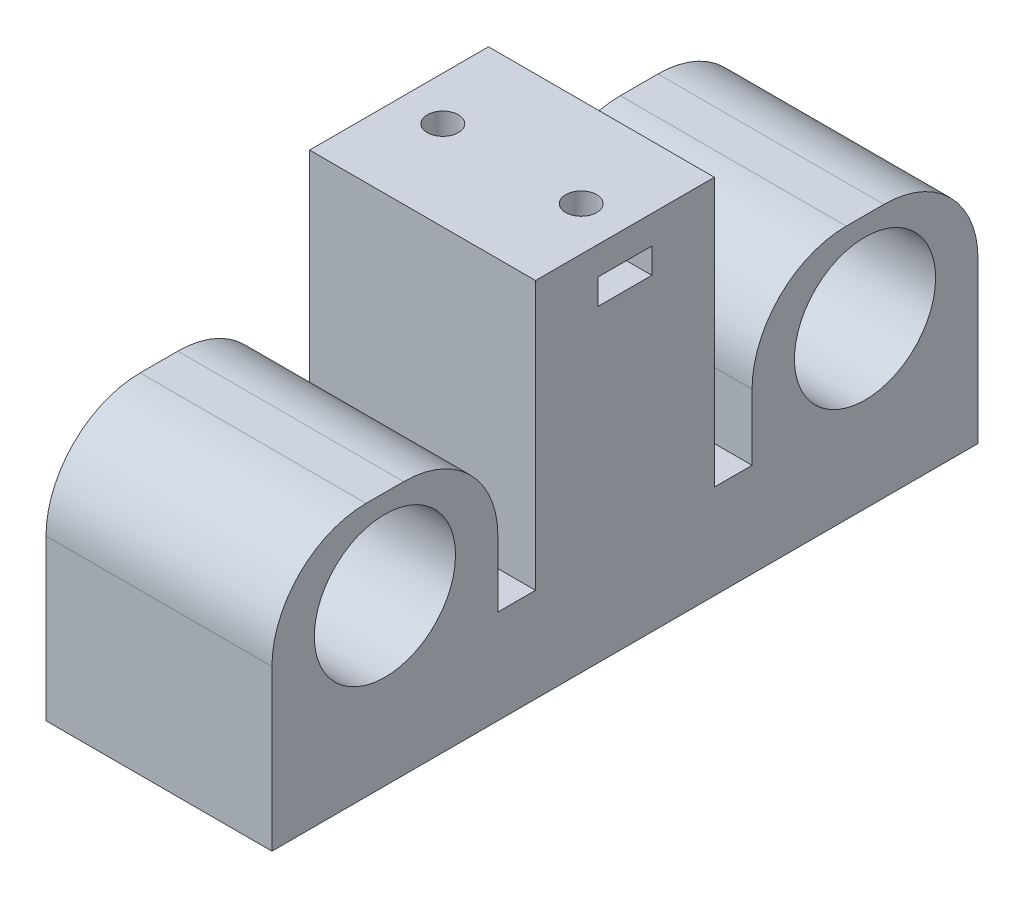
ISO-10303-21;
HEADER;
FILE_DESCRIPTION(('STEP AP214'),'2;1');
FILE_NAME('part.step','',(''),(''),'','','');
FILE_SCHEMA(('AUTOMOTIVE_DESIGN { 1 0 10303 214 1 1 1 1 }'));
ENDSEC;
DATA;
#1=APPLICATION_CONTEXT('core data for automotive mechanical design processes');
#2=APPLICATION_PROTOCOL_DEFINITION('international standard','automotive_design',2000,#1);
#3=PRODUCT_CONTEXT('',#1,'mechanical');
#4=PRODUCT('Part','Part','',(#3));
#5=PRODUCT_RELATED_PRODUCT_CATEGORY('part','',(#4));
#6=PRODUCT_DEFINITION_FORMATION('','',#4);
#7=PRODUCT_DEFINITION_CONTEXT('part definition',#1,'design');
#8=PRODUCT_DEFINITION('design','',#6,#7);
#9=PRODUCT_DEFINITION_SHAPE('','',#8);
#10=(LENGTH_UNIT() NAMED_UNIT(*) SI_UNIT(.MILLI.,.METRE.));
#11=(NAMED_UNIT(*) PLANE_ANGLE_UNIT() SI_UNIT($,.RADIAN.));
#12=(NAMED_UNIT(*) SI_UNIT($,.STERADIAN.) SOLID_ANGLE_UNIT());
#13=UNCERTAINTY_MEASURE_WITH_UNIT(LENGTH_MEASURE(1.E-05),#10,'distance_accuracy_value','');
#14=(GEOMETRIC_REPRESENTATION_CONTEXT(3) GLOBAL_UNCERTAINTY_ASSIGNED_CONTEXT((#13)) GLOBAL_UNIT_ASSIGNED_CONTEXT((#10,
#11,#12)) REPRESENTATION_CONTEXT('',''));
#15=CARTESIAN_POINT('',(0.,0.,0.));
#16=DIRECTION('',(0.,0.,1.));
#17=DIRECTION('',(1.,0.,0.));
#18=AXIS2_PLACEMENT_3D('',#15,#16,#17);
#19=CARTESIAN_POINT('',(0.,10.,-75.));
#20=DIRECTION('',(-1.,0.,0.));
#21=DIRECTION('',(0.,0.,1.));
#22=AXIS2_PLACEMENT_3D('',#19,#20,#21);
#23=PLANE('',#22);
#24=DIRECTION('',(0.,0.,-1.));
#25=VECTOR('',#24,1.);
#26=CARTESIAN_POINT('',(0.,27.,-75.));
#27=LINE('',#26,#25);
#28=CARTESIAN_POINT('',(0.,27.,-61.));
#29=VERTEX_POINT('',#28);
#30=CARTESIAN_POINT('',(0.,27.,-65.));
#31=VERTEX_POINT('',#30);
#32=EDGE_CURVE('E296',#29,#31,#27,.T.);
#33=ORIENTED_EDGE('',*,*,#32,.F.);
#34=CARTESIAN_POINT('',(0.,17.,-61.));
#35=DIRECTION('',(-1.,0.,0.));
#36=DIRECTION('',(0.,0.,1.));
#37=AXIS2_PLACEMENT_3D('',#34,#35,#36);
#38=CIRCLE('',#37,10.);
#39=CARTESIAN_POINT('',(0.,17.,-51.));
#40=VERTEX_POINT('',#39);
#41=EDGE_CURVE('E392',#29,#40,#38,.F.);
#42=ORIENTED_EDGE('',*,*,#41,.T.);
#43=DIRECTION('',(0.,-1.,0.));
#44=VECTOR('',#43,1.);
#45=CARTESIAN_POINT('',(0.,27.,-51.));
#46=LINE('',#45,#44);
#47=CARTESIAN_POINT('',(0.,10.,-51.));
#48=VERTEX_POINT('',#47);
#49=EDGE_CURVE('E299',#40,#48,#46,.T.);
#50=ORIENTED_EDGE('',*,*,#49,.T.);
#51=DIRECTION('',(0.,0.,-1.));
#52=VECTOR('',#51,1.);
#53=CARTESIAN_POINT('',(0.,10.,-75.));
#54=LINE('',#53,#52);
#55=CARTESIAN_POINT('',(0.,10.,-47.));
#56=VERTEX_POINT('',#55);
#57=EDGE_CURVE('E350',#56,#48,#54,.T.);
#58=ORIENTED_EDGE('',*,*,#57,.F.);
#59=DIRECTION('',(0.,-1.,0.));
#60=VECTOR('',#59,1.);
#61=CARTESIAN_POINT('',(0.,38.5,-47.));
#62=LINE('',#61,#60);
#63=CARTESIAN_POINT('',(0.,38.5,-47.));
#64=VERTEX_POINT('',#63);
#65=EDGE_CURVE('E277',#64,#56,#62,.T.);
#66=ORIENTED_EDGE('',*,*,#65,.F.);
#67=DIRECTION('',(0.,0.,-1.));
#68=VECTOR('',#67,1.);
#69=CARTESIAN_POINT('',(0.,38.5,-47.));
#70=LINE('',#69,#68);
#71=CARTESIAN_POINT('',(0.,38.5,-28.));
#72=VERTEX_POINT('',#71);
#73=EDGE_CURVE('E254',#72,#64,#70,.T.);
#74=ORIENTED_EDGE('',*,*,#73,.F.);
#75=DIRECTION('',(0.,-1.,0.));
#76=VECTOR('',#75,1.);
#77=CARTESIAN_POINT('',(0.,38.5,-28.));
#78=LINE('',#77,#76);
#79=CARTESIAN_POINT('',(0.,10.,-28.));
#80=VERTEX_POINT('',#79);
#81=EDGE_CURVE('E264',#72,#80,#78,.T.);
#82=ORIENTED_EDGE('',*,*,#81,.T.);
#83=CARTESIAN_POINT('',(0.,10.,-24.));
#84=VERTEX_POINT('',#83);
#85=EDGE_CURVE('E321',#84,#80,#54,.T.);
#86=ORIENTED_EDGE('',*,*,#85,.F.);
#87=DIRECTION('',(0.,-1.,0.));
#88=VECTOR('',#87,1.);
#89=CARTESIAN_POINT('',(0.,27.,-24.));
#90=LINE('',#89,#88);
#91=CARTESIAN_POINT('',(0.,17.,-24.));
#92=VERTEX_POINT('',#91);
#93=EDGE_CURVE('E331',#92,#84,#90,.T.);
#94=ORIENTED_EDGE('',*,*,#93,.F.);
#95=CARTESIAN_POINT('',(0.,17.,-14.));
#96=DIRECTION('',(-1.,0.,0.));
#97=DIRECTION('',(0.,0.,1.));
#98=AXIS2_PLACEMENT_3D('',#95,#96,#97);
#99=CIRCLE('',#98,10.);
#100=CARTESIAN_POINT('',(0.,27.,-14.));
#101=VERTEX_POINT('',#100);
#102=EDGE_CURVE('E391',#92,#101,#99,.F.);
#103=ORIENTED_EDGE('',*,*,#102,.T.);
#104=DIRECTION('',(0.,0.,-1.));
#105=VECTOR('',#104,1.);
#106=CARTESIAN_POINT('',(0.,27.,0.));
#107=LINE('',#106,#105);
#108=CARTESIAN_POINT('',(0.,27.,-10.));
#109=VERTEX_POINT('',#108);
#110=EDGE_CURVE('E310',#109,#101,#107,.T.);
#111=ORIENTED_EDGE('',*,*,#110,.F.);
#112=CARTESIAN_POINT('',(0.,17.,-10.));
#113=DIRECTION('',(-1.,0.,0.));
#114=DIRECTION('',(0.,0.,1.));
#115=AXIS2_PLACEMENT_3D('',#112,#113,#114);
#116=CIRCLE('',#115,10.);
#117=CARTESIAN_POINT('',(0.,17.,0.));
#118=VERTEX_POINT('',#117);
#119=EDGE_CURVE('E389',#109,#118,#116,.F.);
#120=ORIENTED_EDGE('',*,*,#119,.T.);
#121=DIRECTION('',(0.,-1.,0.));
#122=VECTOR('',#121,1.);
#123=CARTESIAN_POINT('',(0.,10.,0.));
#124=LINE('',#123,#122);
#125=CARTESIAN_POINT('',(0.,0.,0.));
#126=VERTEX_POINT('',#125);
#127=EDGE_CURVE('E371',#118,#126,#124,.T.);
#128=ORIENTED_EDGE('',*,*,#127,.T.);
#129=DIRECTION('',(0.,0.,-1.));
#130=VECTOR('',#129,1.);
#131=CARTESIAN_POINT('',(0.,0.,-75.));
#132=LINE('',#131,#130);
#133=CARTESIAN_POINT('',(0.,0.,-75.));
#134=VERTEX_POINT('',#133);
#135=EDGE_CURVE('E361',#126,#134,#132,.T.);
#136=ORIENTED_EDGE('',*,*,#135,.T.);
#137=DIRECTION('',(0.,-1.,0.));
#138=VECTOR('',#137,1.);
#139=CARTESIAN_POINT('',(0.,10.,-75.));
#140=LINE('',#139,#138);
#141=CARTESIAN_POINT('',(0.,17.,-75.));
#142=VERTEX_POINT('',#141);
#143=EDGE_CURVE('E369',#142,#134,#140,.T.);
#144=ORIENTED_EDGE('',*,*,#143,.F.);
#145=CARTESIAN_POINT('',(0.,17.,-65.));
#146=DIRECTION('',(-1.,0.,0.));
#147=DIRECTION('',(0.,0.,1.));
#148=AXIS2_PLACEMENT_3D('',#145,#146,#147);
#149=CIRCLE('',#148,10.);
#150=EDGE_CURVE('E384',#142,#31,#149,.F.);
#151=ORIENTED_EDGE('',*,*,#150,.T.);
#152=EDGE_LOOP('',(#33,#42,#50,#58,#66,#74,#82,#86,#94,#103,#111,#120,#128,#136,#144,#151));
#153=FACE_BOUND('',#152,.T.);
#154=CARTESIAN_POINT('',(0.,17.5,-12.));
#155=DIRECTION('',(1.,0.,0.));
#156=DIRECTION('',(0.,0.,-1.));
#157=AXIS2_PLACEMENT_3D('',#154,#155,#156);
#158=CIRCLE('',#157,7.5);
#159=CARTESIAN_POINT('',(0.,17.5,-19.5));
#160=VERTEX_POINT('',#159);
#161=EDGE_CURVE('E286',#160,#160,#158,.T.);
#162=ORIENTED_EDGE('',*,*,#161,.F.);
#163=EDGE_LOOP('',(#162));
#164=FACE_BOUND('',#163,.T.);
#165=CARTESIAN_POINT('',(0.,17.5,-63.));
#166=DIRECTION('',(1.,0.,0.));
#167=DIRECTION('',(0.,0.,-1.));
#168=AXIS2_PLACEMENT_3D('',#165,#166,#167);
#169=CIRCLE('',#168,7.50000000000001);
#170=CARTESIAN_POINT('',(0.,17.5,-70.5));
#171=VERTEX_POINT('',#170);
#172=EDGE_CURVE('E280',#171,#171,#169,.T.);
#173=ORIENTED_EDGE('',*,*,#172,.F.);
#174=EDGE_LOOP('',(#173));
#175=FACE_BOUND('',#174,.T.);
#176=DIRECTION('',(0.,0.,-1.));
#177=VECTOR('',#176,1.);
#178=CARTESIAN_POINT('',(0.,35.5,-75.));
#179=LINE('',#178,#177);
#180=CARTESIAN_POINT('',(0.,35.5,-34.65));
#181=VERTEX_POINT('',#180);
#182=CARTESIAN_POINT('',(0.,35.5,-40.35));
#183=VERTEX_POINT('',#182);
#184=EDGE_CURVE('E52',#181,#183,#179,.T.);
#185=ORIENTED_EDGE('',*,*,#184,.T.);
#186=DIRECTION('',(0.,-1.,0.));
#187=VECTOR('',#186,1.);
#188=CARTESIAN_POINT('',(0.,10.0000000000001,-40.3499999999999));
#189=LINE('',#188,#187);
#190=CARTESIAN_POINT('',(0.,32.8,-40.35));
#191=VERTEX_POINT('',#190);
#192=EDGE_CURVE('E216',#183,#191,#189,.T.);
#193=ORIENTED_EDGE('',*,*,#192,.T.);
#194=DIRECTION('',(0.,0.,1.));
#195=VECTOR('',#194,1.);
#196=CARTESIAN_POINT('',(0.,32.8,-75.));
#197=LINE('',#196,#195);
#198=CARTESIAN_POINT('',(0.,32.8,-34.65));
#199=VERTEX_POINT('',#198);
#200=EDGE_CURVE('E738',#191,#199,#197,.T.);
#201=ORIENTED_EDGE('',*,*,#200,.T.);
#202=DIRECTION('',(0.,1.,0.));
#203=VECTOR('',#202,1.);
#204=CARTESIAN_POINT('',(0.,10.0000000000001,-34.6499999999999));
#205=LINE('',#204,#203);
#206=EDGE_CURVE('E212',#199,#181,#205,.T.);
#207=ORIENTED_EDGE('',*,*,#206,.T.);
#208=EDGE_LOOP('',(#185,#193,#201,#207));
#209=FACE_BOUND('',#208,.T.);
#210=ADVANCED_FACE('F34',(#153,#164,#175,#209),#23,.F.);
#211=CARTESIAN_POINT('',(0.,10.,0.));
#212=DIRECTION('',(0.,1.,0.));
#213=DIRECTION('',(0.,0.,1.));
#214=AXIS2_PLACEMENT_3D('',#211,#212,#213);
#215=PLANE('',#214);
#216=DIRECTION('',(0.,0.,1.));
#217=VECTOR('',#216,1.);
#218=CARTESIAN_POINT('',(-24.,10.,-75.));
#219=LINE('',#218,#217);
#220=CARTESIAN_POINT('',(-24.,10.,-51.));
#221=VERTEX_POINT('',#220);
#222=CARTESIAN_POINT('',(-24.,10.,-47.));
#223=VERTEX_POINT('',#222);
#224=EDGE_CURVE('E351',#221,#223,#219,.T.);
#225=ORIENTED_EDGE('',*,*,#224,.T.);
#226=DIRECTION('',(-1.,0.,0.));
#227=VECTOR('',#226,1.);
#228=CARTESIAN_POINT('',(0.,10.,-47.));
#229=LINE('',#228,#227);
#230=EDGE_CURVE('E248',#56,#223,#229,.T.);
#231=ORIENTED_EDGE('',*,*,#230,.F.);
#232=ORIENTED_EDGE('',*,*,#57,.T.);
#233=DIRECTION('',(1.,0.,0.));
#234=VECTOR('',#233,1.);
#235=CARTESIAN_POINT('',(-24.,10.,-51.));
#236=LINE('',#235,#234);
#237=EDGE_CURVE('E292',#221,#48,#236,.T.);
#238=ORIENTED_EDGE('',*,*,#237,.F.);
#239=EDGE_LOOP('',(#225,#231,#232,#238));
#240=FACE_BOUND('',#239,.T.);
#241=ADVANCED_FACE('F456',(#240),#215,.T.);
#242=ORIENTED_EDGE('',*,*,#85,.T.);
#243=DIRECTION('',(1.,0.,0.));
#244=VECTOR('',#243,1.);
#245=CARTESIAN_POINT('',(0.,10.,-28.));
#246=LINE('',#245,#244);
#247=CARTESIAN_POINT('',(-24.,10.,-28.));
#248=VERTEX_POINT('',#247);
#249=EDGE_CURVE('E258',#248,#80,#246,.T.);
#250=ORIENTED_EDGE('',*,*,#249,.F.);
#251=CARTESIAN_POINT('',(-24.,10.,-24.));
#252=VERTEX_POINT('',#251);
#253=EDGE_CURVE('E38',#248,#252,#219,.T.);
#254=ORIENTED_EDGE('',*,*,#253,.T.);
#255=DIRECTION('',(-1.,0.,0.));
#256=VECTOR('',#255,1.);
#257=CARTESIAN_POINT('',(-24.,10.,-24.));
#258=LINE('',#257,#256);
#259=EDGE_CURVE('E306',#84,#252,#258,.T.);
#260=ORIENTED_EDGE('',*,*,#259,.F.);
#261=EDGE_LOOP('',(#242,#250,#254,#260));
#262=FACE_BOUND('',#261,.T.);
#263=ADVANCED_FACE('F445',(#262),#215,.T.);
#264=CARTESIAN_POINT('',(-24.,10.,-75.));
#265=DIRECTION('',(1.,0.,0.));
#266=DIRECTION('',(0.,0.,-1.));
#267=AXIS2_PLACEMENT_3D('',#264,#265,#266);
#268=PLANE('',#267);
#269=DIRECTION('',(0.,0.,1.));
#270=VECTOR('',#269,1.);
#271=CARTESIAN_POINT('',(-24.,32.8,-40.35));
#272=LINE('',#271,#270);
#273=CARTESIAN_POINT('',(-24.,32.8,-40.35));
#274=VERTEX_POINT('',#273);
#275=CARTESIAN_POINT('',(-24.,32.8,-34.65));
#276=VERTEX_POINT('',#275);
#277=EDGE_CURVE('E219',#274,#276,#272,.T.);
#278=ORIENTED_EDGE('',*,*,#277,.F.);
#279=DIRECTION('',(0.,-1.,0.));
#280=VECTOR('',#279,1.);
#281=CARTESIAN_POINT('',(-24.,35.5,-40.35));
#282=LINE('',#281,#280);
#283=CARTESIAN_POINT('',(-24.,35.5,-40.35));
#284=VERTEX_POINT('',#283);
#285=EDGE_CURVE('E60',#284,#274,#282,.T.);
#286=ORIENTED_EDGE('',*,*,#285,.F.);
#287=DIRECTION('',(0.,0.,-1.));
#288=VECTOR('',#287,1.);
#289=CARTESIAN_POINT('',(-24.,35.5,-40.35));
#290=LINE('',#289,#288);
#291=CARTESIAN_POINT('',(-24.,35.5,-34.65));
#292=VERTEX_POINT('',#291);
#293=EDGE_CURVE('E229',#292,#284,#290,.T.);
#294=ORIENTED_EDGE('',*,*,#293,.F.);
#295=DIRECTION('',(0.,1.,0.));
#296=VECTOR('',#295,1.);
#297=CARTESIAN_POINT('',(-24.,35.5,-34.65));
#298=LINE('',#297,#296);
#299=EDGE_CURVE('E241',#276,#292,#298,.T.);
#300=ORIENTED_EDGE('',*,*,#299,.F.);
#301=EDGE_LOOP('',(#278,#286,#294,#300));
#302=FACE_BOUND('',#301,.T.);
#303=CARTESIAN_POINT('',(-24.,17.5,-63.));
#304=DIRECTION('',(1.,0.,0.));
#305=DIRECTION('',(0.,0.,-1.));
#306=AXIS2_PLACEMENT_3D('',#303,#304,#305);
#307=CIRCLE('',#306,7.50000000000001);
#308=CARTESIAN_POINT('',(-24.,17.5,-70.5));
#309=VERTEX_POINT('',#308);
#310=EDGE_CURVE('E283',#309,#309,#307,.T.);
#311=ORIENTED_EDGE('',*,*,#310,.T.);
#312=EDGE_LOOP('',(#311));
#313=FACE_BOUND('',#312,.T.);
#314=CARTESIAN_POINT('',(-24.,17.5,-12.));
#315=DIRECTION('',(1.,0.,0.));
#316=DIRECTION('',(0.,0.,-1.));
#317=AXIS2_PLACEMENT_3D('',#314,#315,#316);
#318=CIRCLE('',#317,7.5);
#319=CARTESIAN_POINT('',(-24.,17.5,-19.5));
#320=VERTEX_POINT('',#319);
#321=EDGE_CURVE('E289',#320,#320,#318,.T.);
#322=ORIENTED_EDGE('',*,*,#321,.T.);
#323=EDGE_LOOP('',(#322));
#324=FACE_BOUND('',#323,.T.);
#325=DIRECTION('',(0.,-1.,0.));
#326=VECTOR('',#325,1.);
#327=CARTESIAN_POINT('',(-24.,27.,-51.));
#328=LINE('',#327,#326);
#329=CARTESIAN_POINT('',(-24.,17.,-51.));
#330=VERTEX_POINT('',#329);
#331=EDGE_CURVE('E304',#330,#221,#328,.T.);
#332=ORIENTED_EDGE('',*,*,#331,.F.);
#333=CARTESIAN_POINT('',(-24.,17.,-61.));
#334=DIRECTION('',(1.,0.,0.));
#335=DIRECTION('',(0.,0.,-1.));
#336=AXIS2_PLACEMENT_3D('',#333,#334,#335);
#337=CIRCLE('',#336,10.);
#338=CARTESIAN_POINT('',(-24.,27.,-61.));
#339=VERTEX_POINT('',#338);
#340=EDGE_CURVE('E340',#330,#339,#337,.F.);
#341=ORIENTED_EDGE('',*,*,#340,.T.);
#342=DIRECTION('',(0.,0.,1.));
#343=VECTOR('',#342,1.);
#344=CARTESIAN_POINT('',(-24.,27.,-75.));
#345=LINE('',#344,#343);
#346=CARTESIAN_POINT('',(-24.,27.,-65.));
#347=VERTEX_POINT('',#346);
#348=EDGE_CURVE('E293',#347,#339,#345,.T.);
#349=ORIENTED_EDGE('',*,*,#348,.F.);
#350=CARTESIAN_POINT('',(-24.,17.,-65.));
#351=DIRECTION('',(1.,0.,0.));
#352=DIRECTION('',(0.,0.,-1.));
#353=AXIS2_PLACEMENT_3D('',#350,#351,#352);
#354=CIRCLE('',#353,10.);
#355=CARTESIAN_POINT('',(-24.,17.,-75.));
#356=VERTEX_POINT('',#355);
#357=EDGE_CURVE('E334',#347,#356,#354,.F.);
#358=ORIENTED_EDGE('',*,*,#357,.T.);
#359=DIRECTION('',(0.,-1.,0.));
#360=VECTOR('',#359,1.);
#361=CARTESIAN_POINT('',(-24.,10.,-75.));
#362=LINE('',#361,#360);
#363=CARTESIAN_POINT('',(-24.,0.,-75.));
#364=VERTEX_POINT('',#363);
#365=EDGE_CURVE('E367',#356,#364,#362,.T.);
#366=ORIENTED_EDGE('',*,*,#365,.T.);
#367=DIRECTION('',(0.,0.,1.));
#368=VECTOR('',#367,1.);
#369=CARTESIAN_POINT('',(-24.,0.,-75.));
#370=LINE('',#369,#368);
#371=CARTESIAN_POINT('',(-24.,0.,0.));
#372=VERTEX_POINT('',#371);
#373=EDGE_CURVE('E354',#364,#372,#370,.T.);
#374=ORIENTED_EDGE('',*,*,#373,.T.);
#375=DIRECTION('',(0.,-1.,0.));
#376=VECTOR('',#375,1.);
#377=CARTESIAN_POINT('',(-24.,10.,0.));
#378=LINE('',#377,#376);
#379=CARTESIAN_POINT('',(-24.,17.,0.));
#380=VERTEX_POINT('',#379);
#381=EDGE_CURVE('E372',#380,#372,#378,.T.);
#382=ORIENTED_EDGE('',*,*,#381,.F.);
#383=CARTESIAN_POINT('',(-24.,17.,-10.));
#384=DIRECTION('',(1.,0.,0.));
#385=DIRECTION('',(0.,0.,-1.));
#386=AXIS2_PLACEMENT_3D('',#383,#384,#385);
#387=CIRCLE('',#386,10.);
#388=CARTESIAN_POINT('',(-24.,27.,-10.));
#389=VERTEX_POINT('',#388);
#390=EDGE_CURVE('E336',#380,#389,#387,.F.);
#391=ORIENTED_EDGE('',*,*,#390,.T.);
#392=DIRECTION('',(0.,0.,1.));
#393=VECTOR('',#392,1.);
#394=CARTESIAN_POINT('',(-24.,27.,0.));
#395=LINE('',#394,#393);
#396=CARTESIAN_POINT('',(-24.,27.,-14.));
#397=VERTEX_POINT('',#396);
#398=EDGE_CURVE('E307',#397,#389,#395,.T.);
#399=ORIENTED_EDGE('',*,*,#398,.F.);
#400=CARTESIAN_POINT('',(-24.,17.,-14.));
#401=DIRECTION('',(1.,0.,0.));
#402=DIRECTION('',(0.,0.,-1.));
#403=AXIS2_PLACEMENT_3D('',#400,#401,#402);
#404=CIRCLE('',#403,10.);
#405=CARTESIAN_POINT('',(-24.,17.,-24.));
#406=VERTEX_POINT('',#405);
#407=EDGE_CURVE('E338',#397,#406,#404,.F.);
#408=ORIENTED_EDGE('',*,*,#407,.T.);
#409=DIRECTION('',(0.,-1.,0.));
#410=VECTOR('',#409,1.);
#411=CARTESIAN_POINT('',(-24.,27.,-24.));
#412=LINE('',#411,#410);
#413=EDGE_CURVE('E313',#406,#252,#412,.T.);
#414=ORIENTED_EDGE('',*,*,#413,.T.);
#415=ORIENTED_EDGE('',*,*,#253,.F.);
#416=DIRECTION('',(0.,-1.,0.));
#417=VECTOR('',#416,1.);
#418=CARTESIAN_POINT('',(-24.,38.5,-28.));
#419=LINE('',#418,#417);
#420=CARTESIAN_POINT('',(-24.,38.5,-28.));
#421=VERTEX_POINT('',#420);
#422=EDGE_CURVE('E271',#421,#248,#419,.T.);
#423=ORIENTED_EDGE('',*,*,#422,.F.);
#424=DIRECTION('',(0.,0.,1.));
#425=VECTOR('',#424,1.);
#426=CARTESIAN_POINT('',(-24.,38.5,-47.));
#427=LINE('',#426,#425);
#428=CARTESIAN_POINT('',(-24.,38.5,-47.));
#429=VERTEX_POINT('',#428);
#430=EDGE_CURVE('E260',#429,#421,#427,.T.);
#431=ORIENTED_EDGE('',*,*,#430,.F.);
#432=DIRECTION('',(0.,-1.,0.));
#433=VECTOR('',#432,1.);
#434=CARTESIAN_POINT('',(-24.,38.5,-47.));
#435=LINE('',#434,#433);
#436=EDGE_CURVE('E274',#429,#223,#435,.T.);
#437=ORIENTED_EDGE('',*,*,#436,.T.);
#438=ORIENTED_EDGE('',*,*,#224,.F.);
#439=EDGE_LOOP('',(#332,#341,#349,#358,#366,#374,#382,#391,#399,#408,#414,#415,#423,#431,#437,#438));
#440=FACE_BOUND('',#439,.T.);
#441=ADVANCED_FACE('F405',(#302,#313,#324,#440),#268,.F.);
#442=CARTESIAN_POINT('',(-24.,10.,0.));
#443=DIRECTION('',(0.,0.,-1.));
#444=DIRECTION('',(-1.,0.,0.));
#445=AXIS2_PLACEMENT_3D('',#442,#443,#444);
#446=PLANE('',#445);
#447=ORIENTED_EDGE('',*,*,#127,.F.);
#448=DIRECTION('',(1.,0.,0.));
#449=VECTOR('',#448,1.);
#450=CARTESIAN_POINT('',(-24.,17.,0.));
#451=LINE('',#450,#449);
#452=EDGE_CURVE('E44',#118,#380,#451,.F.);
#453=ORIENTED_EDGE('',*,*,#452,.T.);
#454=ORIENTED_EDGE('',*,*,#381,.T.);
#455=DIRECTION('',(1.,0.,0.));
#456=VECTOR('',#455,1.);
#457=CARTESIAN_POINT('',(-24.,0.,0.));
#458=LINE('',#457,#456);
#459=EDGE_CURVE('E358',#372,#126,#458,.T.);
#460=ORIENTED_EDGE('',*,*,#459,.T.);
#461=EDGE_LOOP('',(#447,#453,#454,#460));
#462=FACE_BOUND('',#461,.T.);
#463=ADVANCED_FACE('F488',(#462),#446,.F.);
#464=CARTESIAN_POINT('',(-24.,10.,-75.));
#465=DIRECTION('',(0.,0.,1.));
#466=DIRECTION('',(1.,0.,0.));
#467=AXIS2_PLACEMENT_3D('',#464,#465,#466);
#468=PLANE('',#467);
#469=ORIENTED_EDGE('',*,*,#365,.F.);
#470=DIRECTION('',(-1.,0.,0.));
#471=VECTOR('',#470,1.);
#472=CARTESIAN_POINT('',(0.,17.,-75.));
#473=LINE('',#472,#471);
#474=EDGE_CURVE('E11',#356,#142,#473,.F.);
#475=ORIENTED_EDGE('',*,*,#474,.T.);
#476=ORIENTED_EDGE('',*,*,#143,.T.);
#477=DIRECTION('',(-1.,0.,0.));
#478=VECTOR('',#477,1.);
#479=CARTESIAN_POINT('',(-24.,0.,-75.));
#480=LINE('',#479,#478);
#481=EDGE_CURVE('E364',#134,#364,#480,.T.);
#482=ORIENTED_EDGE('',*,*,#481,.T.);
#483=EDGE_LOOP('',(#469,#475,#476,#482));
#484=FACE_BOUND('',#483,.T.);
#485=ADVANCED_FACE('F416',(#484),#468,.F.);
#486=CARTESIAN_POINT('',(0.,0.,0.));
#487=DIRECTION('',(0.,1.,0.));
#488=DIRECTION('',(0.,0.,1.));
#489=AXIS2_PLACEMENT_3D('',#486,#487,#488);
#490=PLANE('',#489);
#491=ORIENTED_EDGE('',*,*,#373,.F.);
#492=ORIENTED_EDGE('',*,*,#481,.F.);
#493=ORIENTED_EDGE('',*,*,#135,.F.);
#494=ORIENTED_EDGE('',*,*,#459,.F.);
#495=EDGE_LOOP('',(#491,#492,#493,#494));
#496=FACE_BOUND('',#495,.T.);
#497=ADVANCED_FACE('F421',(#496),#490,.F.);
#498=CARTESIAN_POINT('',(-24.,27.,-24.));
#499=DIRECTION('',(0.,0.,1.));
#500=DIRECTION('',(1.,0.,0.));
#501=AXIS2_PLACEMENT_3D('',#498,#499,#500);
#502=PLANE('',#501);
#503=ORIENTED_EDGE('',*,*,#413,.F.);
#504=DIRECTION('',(-1.,0.,0.));
#505=VECTOR('',#504,1.);
#506=CARTESIAN_POINT('',(-24.,17.,-24.));
#507=LINE('',#506,#505);
#508=EDGE_CURVE('E348',#406,#92,#507,.F.);
#509=ORIENTED_EDGE('',*,*,#508,.T.);
#510=ORIENTED_EDGE('',*,*,#93,.T.);
#511=ORIENTED_EDGE('',*,*,#259,.T.);
#512=EDGE_LOOP('',(#503,#509,#510,#511));
#513=FACE_BOUND('',#512,.T.);
#514=ADVANCED_FACE('F442',(#513),#502,.F.);
#515=CARTESIAN_POINT('',(0.,27.,0.));
#516=DIRECTION('',(0.,-1.,0.));
#517=DIRECTION('',(0.,0.,-1.));
#518=AXIS2_PLACEMENT_3D('',#515,#516,#517);
#519=PLANE('',#518);
#520=ORIENTED_EDGE('',*,*,#110,.T.);
#521=DIRECTION('',(-1.,0.,0.));
#522=VECTOR('',#521,1.);
#523=CARTESIAN_POINT('',(0.,27.,-14.));
#524=LINE('',#523,#522);
#525=EDGE_CURVE('E345',#101,#397,#524,.T.);
#526=ORIENTED_EDGE('',*,*,#525,.T.);
#527=ORIENTED_EDGE('',*,*,#398,.T.);
#528=DIRECTION('',(1.,0.,0.));
#529=VECTOR('',#528,1.);
#530=CARTESIAN_POINT('',(0.,27.,-10.));
#531=LINE('',#530,#529);
#532=EDGE_CURVE('E342',#389,#109,#531,.T.);
#533=ORIENTED_EDGE('',*,*,#532,.T.);
#534=EDGE_LOOP('',(#520,#526,#527,#533));
#535=FACE_BOUND('',#534,.T.);
#536=ADVANCED_FACE('F430',(#535),#519,.F.);
#537=CARTESIAN_POINT('',(-24.,27.,-51.));
#538=DIRECTION('',(0.,0.,-1.));
#539=DIRECTION('',(-1.,0.,0.));
#540=AXIS2_PLACEMENT_3D('',#537,#538,#539);
#541=PLANE('',#540);
#542=ORIENTED_EDGE('',*,*,#49,.F.);
#543=DIRECTION('',(1.,0.,0.));
#544=VECTOR('',#543,1.);
#545=CARTESIAN_POINT('',(-24.,17.,-51.));
#546=LINE('',#545,#544);
#547=EDGE_CURVE('E332',#40,#330,#546,.F.);
#548=ORIENTED_EDGE('',*,*,#547,.T.);
#549=ORIENTED_EDGE('',*,*,#331,.T.);
#550=ORIENTED_EDGE('',*,*,#237,.T.);
#551=EDGE_LOOP('',(#542,#548,#549,#550));
#552=FACE_BOUND('',#551,.T.);
#553=ADVANCED_FACE('F399',(#552),#541,.F.);
#554=CARTESIAN_POINT('',(0.,27.,0.));
#555=DIRECTION('',(0.,1.,0.));
#556=DIRECTION('',(0.,0.,1.));
#557=AXIS2_PLACEMENT_3D('',#554,#555,#556);
#558=PLANE('',#557);
#559=ORIENTED_EDGE('',*,*,#348,.T.);
#560=DIRECTION('',(1.,0.,0.));
#561=VECTOR('',#560,1.);
#562=CARTESIAN_POINT('',(0.,27.,-61.));
#563=LINE('',#562,#561);
#564=EDGE_CURVE('E378',#339,#29,#563,.T.);
#565=ORIENTED_EDGE('',*,*,#564,.T.);
#566=ORIENTED_EDGE('',*,*,#32,.T.);
#567=DIRECTION('',(-1.,0.,0.));
#568=VECTOR('',#567,1.);
#569=CARTESIAN_POINT('',(-24.,27.,-65.));
#570=LINE('',#569,#568);
#571=EDGE_CURVE('E373',#31,#347,#570,.T.);
#572=ORIENTED_EDGE('',*,*,#571,.T.);
#573=EDGE_LOOP('',(#559,#565,#566,#572));
#574=FACE_BOUND('',#573,.T.);
#575=ADVANCED_FACE('F408',(#574),#558,.T.);
#576=CARTESIAN_POINT('',(-24.00005,17.5,-12.));
#577=DIRECTION('',(1.,0.,0.));
#578=DIRECTION('',(0.,0.,-1.));
#579=AXIS2_PLACEMENT_3D('',#576,#577,#578);
#580=CYLINDRICAL_SURFACE('',#579,7.5);
#581=ORIENTED_EDGE('',*,*,#161,.T.);
#582=EDGE_LOOP('',(#581));
#583=FACE_BOUND('',#582,.T.);
#584=ORIENTED_EDGE('',*,*,#321,.F.);
#585=EDGE_LOOP('',(#584));
#586=FACE_BOUND('',#585,.T.);
#587=ADVANCED_FACE('F511',(#583,#586),#580,.F.);
#588=CARTESIAN_POINT('',(-24.00005,17.5,-63.));
#589=DIRECTION('',(1.,0.,0.));
#590=DIRECTION('',(0.,0.,-1.));
#591=AXIS2_PLACEMENT_3D('',#588,#589,#590);
#592=CYLINDRICAL_SURFACE('',#591,7.50000000000001);
#593=ORIENTED_EDGE('',*,*,#172,.T.);
#594=EDGE_LOOP('',(#593));
#595=FACE_BOUND('',#594,.T.);
#596=ORIENTED_EDGE('',*,*,#310,.F.);
#597=EDGE_LOOP('',(#596));
#598=FACE_BOUND('',#597,.T.);
#599=ADVANCED_FACE('F496',(#595,#598),#592,.F.);
#600=CARTESIAN_POINT('',(0.,17.,-61.));
#601=DIRECTION('',(-1.,0.,0.));
#602=DIRECTION('',(0.,0.,1.));
#603=AXIS2_PLACEMENT_3D('',#600,#601,#602);
#604=CYLINDRICAL_SURFACE('',#603,10.);
#605=ORIENTED_EDGE('',*,*,#340,.F.);
#606=ORIENTED_EDGE('',*,*,#547,.F.);
#607=ORIENTED_EDGE('',*,*,#41,.F.);
#608=ORIENTED_EDGE('',*,*,#564,.F.);
#609=EDGE_LOOP('',(#605,#606,#607,#608));
#610=FACE_BOUND('',#609,.T.);
#611=ADVANCED_FACE('F407',(#610),#604,.T.);
#612=CARTESIAN_POINT('',(0.,17.,-14.));
#613=DIRECTION('',(-1.,0.,0.));
#614=DIRECTION('',(0.,0.,1.));
#615=AXIS2_PLACEMENT_3D('',#612,#613,#614);
#616=CYLINDRICAL_SURFACE('',#615,10.);
#617=ORIENTED_EDGE('',*,*,#102,.F.);
#618=ORIENTED_EDGE('',*,*,#508,.F.);
#619=ORIENTED_EDGE('',*,*,#407,.F.);
#620=ORIENTED_EDGE('',*,*,#525,.F.);
#621=EDGE_LOOP('',(#617,#618,#619,#620));
#622=FACE_BOUND('',#621,.T.);
#623=ADVANCED_FACE('F438',(#622),#616,.T.);
#624=CARTESIAN_POINT('',(0.,17.,-10.));
#625=DIRECTION('',(1.,0.,0.));
#626=DIRECTION('',(0.,0.,-1.));
#627=AXIS2_PLACEMENT_3D('',#624,#625,#626);
#628=CYLINDRICAL_SURFACE('',#627,10.);
#629=ORIENTED_EDGE('',*,*,#390,.F.);
#630=ORIENTED_EDGE('',*,*,#452,.F.);
#631=ORIENTED_EDGE('',*,*,#119,.F.);
#632=ORIENTED_EDGE('',*,*,#532,.F.);
#633=EDGE_LOOP('',(#629,#630,#631,#632));
#634=FACE_BOUND('',#633,.T.);
#635=ADVANCED_FACE('F427',(#634),#628,.T.);
#636=CARTESIAN_POINT('',(0.,17.,-65.));
#637=DIRECTION('',(1.,0.,0.));
#638=DIRECTION('',(0.,0.,-1.));
#639=AXIS2_PLACEMENT_3D('',#636,#637,#638);
#640=CYLINDRICAL_SURFACE('',#639,10.);
#641=ORIENTED_EDGE('',*,*,#150,.F.);
#642=ORIENTED_EDGE('',*,*,#474,.F.);
#643=ORIENTED_EDGE('',*,*,#357,.F.);
#644=ORIENTED_EDGE('',*,*,#571,.F.);
#645=EDGE_LOOP('',(#641,#642,#643,#644));
#646=FACE_BOUND('',#645,.T.);
#647=ADVANCED_FACE('F36',(#646),#640,.T.);
#648=CARTESIAN_POINT('',(0.,38.5,-47.));
#649=DIRECTION('',(0.,0.,1.));
#650=DIRECTION('',(1.,0.,0.));
#651=AXIS2_PLACEMENT_3D('',#648,#649,#650);
#652=PLANE('',#651);
#653=ORIENTED_EDGE('',*,*,#230,.T.);
#654=ORIENTED_EDGE('',*,*,#436,.F.);
#655=DIRECTION('',(-1.,0.,0.));
#656=VECTOR('',#655,1.);
#657=CARTESIAN_POINT('',(0.,38.5,-47.));
#658=LINE('',#657,#656);
#659=EDGE_CURVE('E257',#64,#429,#658,.T.);
#660=ORIENTED_EDGE('',*,*,#659,.F.);
#661=ORIENTED_EDGE('',*,*,#65,.T.);
#662=EDGE_LOOP('',(#653,#654,#660,#661));
#663=FACE_BOUND('',#662,.T.);
#664=ADVANCED_FACE('F459',(#663),#652,.F.);
#665=CARTESIAN_POINT('',(0.,38.5,-28.));
#666=DIRECTION('',(0.,0.,-1.));
#667=DIRECTION('',(-1.,0.,0.));
#668=AXIS2_PLACEMENT_3D('',#665,#666,#667);
#669=PLANE('',#668);
#670=ORIENTED_EDGE('',*,*,#249,.T.);
#671=ORIENTED_EDGE('',*,*,#81,.F.);
#672=DIRECTION('',(1.,0.,0.));
#673=VECTOR('',#672,1.);
#674=CARTESIAN_POINT('',(0.,38.5,-28.));
#675=LINE('',#674,#673);
#676=EDGE_CURVE('E262',#421,#72,#675,.T.);
#677=ORIENTED_EDGE('',*,*,#676,.F.);
#678=ORIENTED_EDGE('',*,*,#422,.T.);
#679=EDGE_LOOP('',(#670,#671,#677,#678));
#680=FACE_BOUND('',#679,.T.);
#681=ADVANCED_FACE('F451',(#680),#669,.F.);
#682=CARTESIAN_POINT('',(0.,38.5,0.));
#683=DIRECTION('',(0.,-1.,0.));
#684=DIRECTION('',(0.,0.,-1.));
#685=AXIS2_PLACEMENT_3D('',#682,#683,#684);
#686=PLANE('',#685);
#687=CARTESIAN_POINT('',(-19.35,38.5,-37.5));
#688=DIRECTION('',(0.,1.,0.));
#689=DIRECTION('',(0.,0.,1.));
#690=AXIS2_PLACEMENT_3D('',#687,#688,#689);
#691=CIRCLE('',#690,1.65);
#692=CARTESIAN_POINT('',(-19.35,38.5,-35.85));
#693=VERTEX_POINT('',#692);
#694=EDGE_CURVE('E724',#693,#693,#691,.T.);
#695=ORIENTED_EDGE('',*,*,#694,.F.);
#696=EDGE_LOOP('',(#695));
#697=FACE_BOUND('',#696,.T.);
#698=CARTESIAN_POINT('',(-4.65,38.5,-37.5));
#699=DIRECTION('',(0.,1.,0.));
#700=DIRECTION('',(0.,0.,1.));
#701=AXIS2_PLACEMENT_3D('',#698,#699,#700);
#702=CIRCLE('',#701,1.65);
#703=CARTESIAN_POINT('',(-4.65,38.5,-35.85));
#704=VERTEX_POINT('',#703);
#705=EDGE_CURVE('E727',#704,#704,#702,.T.);
#706=ORIENTED_EDGE('',*,*,#705,.F.);
#707=EDGE_LOOP('',(#706));
#708=FACE_BOUND('',#707,.T.);
#709=ORIENTED_EDGE('',*,*,#73,.T.);
#710=ORIENTED_EDGE('',*,*,#659,.T.);
#711=ORIENTED_EDGE('',*,*,#430,.T.);
#712=ORIENTED_EDGE('',*,*,#676,.T.);
#713=EDGE_LOOP('',(#709,#710,#711,#712));
#714=FACE_BOUND('',#713,.T.);
#715=ADVANCED_FACE('F461',(#697,#708,#714),#686,.F.);
#716=CARTESIAN_POINT('',(-13.,35.5,-40.35));
#717=DIRECTION('',(0.,0.,-1.));
#718=DIRECTION('',(0.,1.,0.));
#719=AXIS2_PLACEMENT_3D('',#716,#717,#718);
#720=PLANE('',#719);
#721=ORIENTED_EDGE('',*,*,#285,.T.);
#722=DIRECTION('',(-1.,0.,0.));
#723=VECTOR('',#722,1.);
#724=CARTESIAN_POINT('',(-13.,32.8,-40.35));
#725=LINE('',#724,#723);
#726=CARTESIAN_POINT('',(-13.,32.8,-40.35));
#727=VERTEX_POINT('',#726);
#728=EDGE_CURVE('E237',#727,#274,#725,.T.);
#729=ORIENTED_EDGE('',*,*,#728,.F.);
#730=DIRECTION('',(0.,-1.,0.));
#731=VECTOR('',#730,1.);
#732=CARTESIAN_POINT('',(-13.,35.5,-40.35));
#733=LINE('',#732,#731);
#734=CARTESIAN_POINT('',(-13.,35.5,-40.35));
#735=VERTEX_POINT('',#734);
#736=EDGE_CURVE('E225',#735,#727,#733,.T.);
#737=ORIENTED_EDGE('',*,*,#736,.F.);
#738=DIRECTION('',(-1.,0.,0.));
#739=VECTOR('',#738,1.);
#740=CARTESIAN_POINT('',(-13.,35.5,-40.35));
#741=LINE('',#740,#739);
#742=EDGE_CURVE('E246',#735,#284,#741,.T.);
#743=ORIENTED_EDGE('',*,*,#742,.T.);
#744=EDGE_LOOP('',(#721,#729,#737,#743));
#745=FACE_BOUND('',#744,.T.);
#746=ADVANCED_FACE('F463',(#745),#720,.F.);
#747=CARTESIAN_POINT('',(-13.,35.5,-40.35));
#748=DIRECTION('',(0.,1.,0.));
#749=DIRECTION('',(0.,0.,1.));
#750=AXIS2_PLACEMENT_3D('',#747,#748,#749);
#751=PLANE('',#750);
#752=CARTESIAN_POINT('',(-19.35,35.5,-37.5));
#753=DIRECTION('',(0.,1.,0.));
#754=DIRECTION('',(0.,0.,1.));
#755=AXIS2_PLACEMENT_3D('',#752,#753,#754);
#756=CIRCLE('',#755,1.65);
#757=CARTESIAN_POINT('',(-19.35,35.5,-35.85));
#758=VERTEX_POINT('',#757);
#759=EDGE_CURVE('E709',#758,#758,#756,.F.);
#760=ORIENTED_EDGE('',*,*,#759,.F.);
#761=EDGE_LOOP('',(#760));
#762=FACE_BOUND('',#761,.T.);
#763=ORIENTED_EDGE('',*,*,#293,.T.);
#764=ORIENTED_EDGE('',*,*,#742,.F.);
#765=DIRECTION('',(0.,0.,-1.));
#766=VECTOR('',#765,1.);
#767=CARTESIAN_POINT('',(-13.,35.5,-40.35));
#768=LINE('',#767,#766);
#769=CARTESIAN_POINT('',(-13.,35.5,-34.65));
#770=VERTEX_POINT('',#769);
#771=EDGE_CURVE('E235',#770,#735,#768,.T.);
#772=ORIENTED_EDGE('',*,*,#771,.F.);
#773=DIRECTION('',(-1.,0.,0.));
#774=VECTOR('',#773,1.);
#775=CARTESIAN_POINT('',(-13.,35.5,-34.65));
#776=LINE('',#775,#774);
#777=EDGE_CURVE('E249',#770,#292,#776,.T.);
#778=ORIENTED_EDGE('',*,*,#777,.T.);
#779=EDGE_LOOP('',(#763,#764,#772,#778));
#780=FACE_BOUND('',#779,.T.);
#781=ADVANCED_FACE('F471',(#762,#780),#751,.F.);
#782=CARTESIAN_POINT('',(-13.,35.5,-34.65));
#783=DIRECTION('',(0.,0.,1.));
#784=DIRECTION('',(0.,-1.,0.));
#785=AXIS2_PLACEMENT_3D('',#782,#783,#784);
#786=PLANE('',#785);
#787=ORIENTED_EDGE('',*,*,#299,.T.);
#788=ORIENTED_EDGE('',*,*,#777,.F.);
#789=DIRECTION('',(0.,1.,0.));
#790=VECTOR('',#789,1.);
#791=CARTESIAN_POINT('',(-13.,35.5,-34.65));
#792=LINE('',#791,#790);
#793=CARTESIAN_POINT('',(-13.,32.8,-34.65));
#794=VERTEX_POINT('',#793);
#795=EDGE_CURVE('E232',#794,#770,#792,.T.);
#796=ORIENTED_EDGE('',*,*,#795,.F.);
#797=DIRECTION('',(-1.,0.,0.));
#798=VECTOR('',#797,1.);
#799=CARTESIAN_POINT('',(-13.,32.8,-34.65));
#800=LINE('',#799,#798);
#801=EDGE_CURVE('E251',#794,#276,#800,.T.);
#802=ORIENTED_EDGE('',*,*,#801,.T.);
#803=EDGE_LOOP('',(#787,#788,#796,#802));
#804=FACE_BOUND('',#803,.T.);
#805=ADVANCED_FACE('F609',(#804),#786,.F.);
#806=CARTESIAN_POINT('',(-13.,32.8,-40.35));
#807=DIRECTION('',(0.,-1.,0.));
#808=DIRECTION('',(0.,0.,-1.));
#809=AXIS2_PLACEMENT_3D('',#806,#807,#808);
#810=PLANE('',#809);
#811=ORIENTED_EDGE('',*,*,#277,.T.);
#812=ORIENTED_EDGE('',*,*,#801,.F.);
#813=DIRECTION('',(0.,0.,1.));
#814=VECTOR('',#813,1.);
#815=CARTESIAN_POINT('',(-13.,32.8,-40.35));
#816=LINE('',#815,#814);
#817=EDGE_CURVE('E228',#727,#794,#816,.T.);
#818=ORIENTED_EDGE('',*,*,#817,.F.);
#819=ORIENTED_EDGE('',*,*,#728,.T.);
#820=EDGE_LOOP('',(#811,#812,#818,#819));
#821=FACE_BOUND('',#820,.T.);
#822=ADVANCED_FACE('F614',(#821),#810,.F.);
#823=CARTESIAN_POINT('',(-13.,0.,0.));
#824=DIRECTION('',(-1.,0.,0.));
#825=DIRECTION('',(0.,0.,1.));
#826=AXIS2_PLACEMENT_3D('',#823,#824,#825);
#827=PLANE('',#826);
#828=ORIENTED_EDGE('',*,*,#736,.T.);
#829=ORIENTED_EDGE('',*,*,#817,.T.);
#830=ORIENTED_EDGE('',*,*,#795,.T.);
#831=ORIENTED_EDGE('',*,*,#771,.T.);
#832=EDGE_LOOP('',(#828,#829,#830,#831));
#833=FACE_BOUND('',#832,.T.);
#834=ADVANCED_FACE('F623',(#833),#827,.T.);
#835=CARTESIAN_POINT('',(-11.,35.5,-75.));
#836=DIRECTION('',(0.,-1.,0.));
#837=DIRECTION('',(0.,0.,-1.));
#838=AXIS2_PLACEMENT_3D('',#835,#836,#837);
#839=PLANE('',#838);
#840=CARTESIAN_POINT('',(-4.65,35.5,-37.5));
#841=DIRECTION('',(0.,-1.,0.));
#842=DIRECTION('',(0.,0.,-1.));
#843=AXIS2_PLACEMENT_3D('',#840,#841,#842);
#844=CIRCLE('',#843,1.65);
#845=CARTESIAN_POINT('',(-4.65,35.5,-39.15));
#846=VERTEX_POINT('',#845);
#847=EDGE_CURVE('E723',#846,#846,#844,.F.);
#848=ORIENTED_EDGE('',*,*,#847,.T.);
#849=EDGE_LOOP('',(#848));
#850=FACE_BOUND('',#849,.T.);
#851=ORIENTED_EDGE('',*,*,#184,.F.);
#852=DIRECTION('',(1.,0.,0.));
#853=VECTOR('',#852,1.);
#854=CARTESIAN_POINT('',(-11.,35.5,-34.65));
#855=LINE('',#854,#853);
#856=CARTESIAN_POINT('',(-11.,35.5,-34.65));
#857=VERTEX_POINT('',#856);
#858=EDGE_CURVE('E211',#857,#181,#855,.T.);
#859=ORIENTED_EDGE('',*,*,#858,.F.);
#860=DIRECTION('',(0.,0.,-1.));
#861=VECTOR('',#860,1.);
#862=CARTESIAN_POINT('',(-11.,35.5,-75.));
#863=LINE('',#862,#861);
#864=CARTESIAN_POINT('',(-11.,35.5,-40.35));
#865=VERTEX_POINT('',#864);
#866=EDGE_CURVE('E203',#857,#865,#863,.T.);
#867=ORIENTED_EDGE('',*,*,#866,.T.);
#868=DIRECTION('',(1.,0.,0.));
#869=VECTOR('',#868,1.);
#870=CARTESIAN_POINT('',(-11.,35.5,-40.35));
#871=LINE('',#870,#869);
#872=EDGE_CURVE('E210',#865,#183,#871,.T.);
#873=ORIENTED_EDGE('',*,*,#872,.T.);
#874=EDGE_LOOP('',(#851,#859,#867,#873));
#875=FACE_BOUND('',#874,.T.);
#876=ADVANCED_FACE('F209',(#850,#875),#839,.T.);
#877=CARTESIAN_POINT('',(-11.,10.0000000000001,-40.3499999999999));
#878=DIRECTION('',(0.,0.,1.));
#879=DIRECTION('',(0.,-1.,0.));
#880=AXIS2_PLACEMENT_3D('',#877,#878,#879);
#881=PLANE('',#880);
#882=ORIENTED_EDGE('',*,*,#192,.F.);
#883=ORIENTED_EDGE('',*,*,#872,.F.);
#884=DIRECTION('',(0.,-1.,0.));
#885=VECTOR('',#884,1.);
#886=CARTESIAN_POINT('',(-11.,10.0000000000001,-40.3499999999999));
#887=LINE('',#886,#885);
#888=CARTESIAN_POINT('',(-11.,32.8,-40.35));
#889=VERTEX_POINT('',#888);
#890=EDGE_CURVE('E199',#865,#889,#887,.T.);
#891=ORIENTED_EDGE('',*,*,#890,.T.);
#892=DIRECTION('',(1.,0.,0.));
#893=VECTOR('',#892,1.);
#894=CARTESIAN_POINT('',(-11.,32.8,-40.35));
#895=LINE('',#894,#893);
#896=EDGE_CURVE('E217',#889,#191,#895,.T.);
#897=ORIENTED_EDGE('',*,*,#896,.T.);
#898=EDGE_LOOP('',(#882,#883,#891,#897));
#899=FACE_BOUND('',#898,.T.);
#900=ADVANCED_FACE('F214',(#899),#881,.T.);
#901=CARTESIAN_POINT('',(-11.,32.8,-75.));
#902=DIRECTION('',(0.,1.,0.));
#903=DIRECTION('',(0.,0.,1.));
#904=AXIS2_PLACEMENT_3D('',#901,#902,#903);
#905=PLANE('',#904);
#906=ORIENTED_EDGE('',*,*,#200,.F.);
#907=ORIENTED_EDGE('',*,*,#896,.F.);
#908=DIRECTION('',(0.,0.,1.));
#909=VECTOR('',#908,1.);
#910=CARTESIAN_POINT('',(-11.,32.8,-75.));
#911=LINE('',#910,#909);
#912=CARTESIAN_POINT('',(-11.,32.8,-34.65));
#913=VERTEX_POINT('',#912);
#914=EDGE_CURVE('E204',#889,#913,#911,.T.);
#915=ORIENTED_EDGE('',*,*,#914,.T.);
#916=DIRECTION('',(1.,0.,0.));
#917=VECTOR('',#916,1.);
#918=CARTESIAN_POINT('',(-11.,32.8,-34.65));
#919=LINE('',#918,#917);
#920=EDGE_CURVE('E221',#913,#199,#919,.T.);
#921=ORIENTED_EDGE('',*,*,#920,.T.);
#922=EDGE_LOOP('',(#906,#907,#915,#921));
#923=FACE_BOUND('',#922,.T.);
#924=ADVANCED_FACE('F652',(#923),#905,.T.);
#925=CARTESIAN_POINT('',(-11.,10.0000000000001,-34.6499999999999));
#926=DIRECTION('',(0.,0.,-1.));
#927=DIRECTION('',(0.,1.,0.));
#928=AXIS2_PLACEMENT_3D('',#925,#926,#927);
#929=PLANE('',#928);
#930=ORIENTED_EDGE('',*,*,#206,.F.);
#931=ORIENTED_EDGE('',*,*,#920,.F.);
#932=DIRECTION('',(0.,1.,0.));
#933=VECTOR('',#932,1.);
#934=CARTESIAN_POINT('',(-11.,10.0000000000001,-34.6499999999999));
#935=LINE('',#934,#933);
#936=EDGE_CURVE('E734',#913,#857,#935,.T.);
#937=ORIENTED_EDGE('',*,*,#936,.T.);
#938=ORIENTED_EDGE('',*,*,#858,.T.);
#939=EDGE_LOOP('',(#930,#931,#937,#938));
#940=FACE_BOUND('',#939,.T.);
#941=ADVANCED_FACE('F658',(#940),#929,.T.);
#942=CARTESIAN_POINT('',(-11.,0.,0.));
#943=DIRECTION('',(-1.,0.,0.));
#944=DIRECTION('',(0.,0.,1.));
#945=AXIS2_PLACEMENT_3D('',#942,#943,#944);
#946=PLANE('',#945);
#947=ORIENTED_EDGE('',*,*,#866,.F.);
#948=ORIENTED_EDGE('',*,*,#936,.F.);
#949=ORIENTED_EDGE('',*,*,#914,.F.);
#950=ORIENTED_EDGE('',*,*,#890,.F.);
#951=EDGE_LOOP('',(#947,#948,#949,#950));
#952=FACE_BOUND('',#951,.T.);
#953=ADVANCED_FACE('F201',(#952),#946,.F.);
#954=CARTESIAN_POINT('',(-4.65,-0.001000000000001,-37.5));
#955=DIRECTION('',(0.,1.,0.));
#956=DIRECTION('',(0.,0.,1.));
#957=AXIS2_PLACEMENT_3D('',#954,#955,#956);
#958=CYLINDRICAL_SURFACE('',#957,1.65);
#959=ORIENTED_EDGE('',*,*,#847,.F.);
#960=EDGE_LOOP('',(#959));
#961=FACE_BOUND('',#960,.T.);
#962=ORIENTED_EDGE('',*,*,#705,.T.);
#963=EDGE_LOOP('',(#962));
#964=FACE_BOUND('',#963,.T.);
#965=ADVANCED_FACE('F672',(#961,#964),#958,.F.);
#966=CARTESIAN_POINT('',(-19.35,-0.001000000000001,-37.5));
#967=DIRECTION('',(0.,1.,0.));
#968=DIRECTION('',(0.,0.,1.));
#969=AXIS2_PLACEMENT_3D('',#966,#967,#968);
#970=CYLINDRICAL_SURFACE('',#969,1.65);
#971=ORIENTED_EDGE('',*,*,#694,.T.);
#972=EDGE_LOOP('',(#971));
#973=FACE_BOUND('',#972,.T.);
#974=ORIENTED_EDGE('',*,*,#759,.T.);
#975=EDGE_LOOP('',(#974));
#976=FACE_BOUND('',#975,.T.);
#977=ADVANCED_FACE('F678',(#973,#976),#970,.F.);
#978=CLOSED_SHELL('',(#210,#241,#263,#441,#463,#485,#497,#514,#536,#553,#575,#587,#599,#611,
#623,#635,#647,#664,#681,#715,#746,#781,#805,#822,#834,#876,#900,#924,#941,#953,#965,#977));
#979=MANIFOLD_SOLID_BREP('B2',#978);
#980=ADVANCED_BREP_SHAPE_REPRESENTATION('',(#18,#979),#14);
#981=SHAPE_DEFINITION_REPRESENTATION(#9,#980);
ENDSEC;
END-ISO-10303-21;
